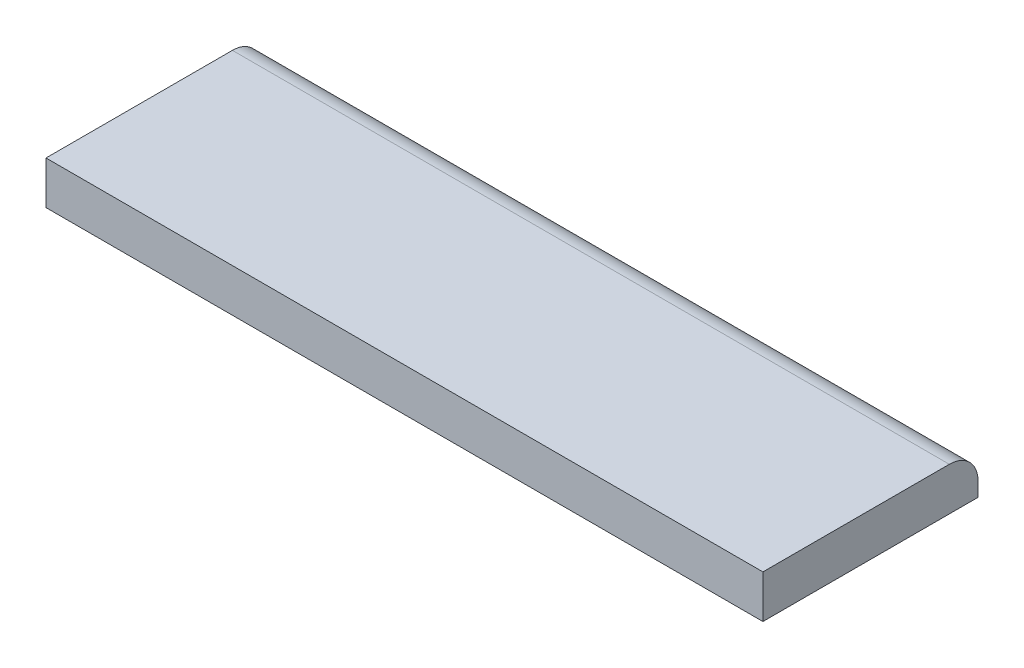
ISO-10303-21;
HEADER;
FILE_DESCRIPTION(('STEP AP214'),'2;1');
FILE_NAME('part.step','',(''),(''),'','','');
FILE_SCHEMA(('AUTOMOTIVE_DESIGN { 1 0 10303 214 1 1 1 1 }'));
ENDSEC;
DATA;
#1=APPLICATION_CONTEXT('core data for automotive mechanical design processes');
#2=APPLICATION_PROTOCOL_DEFINITION('international standard','automotive_design',2000,#1);
#3=PRODUCT_CONTEXT('',#1,'mechanical');
#4=PRODUCT('Part','Part','',(#3));
#5=PRODUCT_RELATED_PRODUCT_CATEGORY('part','',(#4));
#6=PRODUCT_DEFINITION_FORMATION('','',#4);
#7=PRODUCT_DEFINITION_CONTEXT('part definition',#1,'design');
#8=PRODUCT_DEFINITION('design','',#6,#7);
#9=PRODUCT_DEFINITION_SHAPE('','',#8);
#10=(LENGTH_UNIT() NAMED_UNIT(*) SI_UNIT(.MILLI.,.METRE.));
#11=(NAMED_UNIT(*) PLANE_ANGLE_UNIT() SI_UNIT($,.RADIAN.));
#12=(NAMED_UNIT(*) SI_UNIT($,.STERADIAN.) SOLID_ANGLE_UNIT());
#13=UNCERTAINTY_MEASURE_WITH_UNIT(LENGTH_MEASURE(1.E-05),#10,'distance_accuracy_value','');
#14=(GEOMETRIC_REPRESENTATION_CONTEXT(3) GLOBAL_UNCERTAINTY_ASSIGNED_CONTEXT((#13)) GLOBAL_UNIT_ASSIGNED_CONTEXT((#10,
#11,#12)) REPRESENTATION_CONTEXT('',''));
#15=CARTESIAN_POINT('',(0.,0.,0.));
#16=DIRECTION('',(0.,0.,1.));
#17=DIRECTION('',(1.,0.,0.));
#18=AXIS2_PLACEMENT_3D('',#15,#16,#17);
#19=CARTESIAN_POINT('',(0.,3.,0.));
#20=DIRECTION('',(1.,0.,0.));
#21=DIRECTION('',(0.,0.,-1.));
#22=AXIS2_PLACEMENT_3D('',#19,#20,#21);
#23=PLANE('',#22);
#24=DIRECTION('',(0.,0.,1.));
#25=VECTOR('',#24,1.);
#26=CARTESIAN_POINT('',(0.,3.,0.));
#27=LINE('',#26,#25);
#28=CARTESIAN_POINT('',(0.,3.,-13.));
#29=VERTEX_POINT('',#28);
#30=CARTESIAN_POINT('',(0.,3.,0.));
#31=VERTEX_POINT('',#30);
#32=EDGE_CURVE('E76',#29,#31,#27,.T.);
#33=ORIENTED_EDGE('',*,*,#32,.F.);
#34=CARTESIAN_POINT('',(0.,1.,-13.));
#35=DIRECTION('',(1.,0.,0.));
#36=DIRECTION('',(0.,0.,-1.));
#37=AXIS2_PLACEMENT_3D('',#34,#35,#36);
#38=CIRCLE('',#37,2.);
#39=CARTESIAN_POINT('',(0.,1.,-15.));
#40=VERTEX_POINT('',#39);
#41=EDGE_CURVE('E54',#29,#40,#38,.F.);
#42=ORIENTED_EDGE('',*,*,#41,.T.);
#43=DIRECTION('',(0.,-1.,0.));
#44=VECTOR('',#43,1.);
#45=CARTESIAN_POINT('',(0.,3.,-15.));
#46=LINE('',#45,#44);
#47=CARTESIAN_POINT('',(0.,0.,-15.));
#48=VERTEX_POINT('',#47);
#49=EDGE_CURVE('E106',#40,#48,#46,.T.);
#50=ORIENTED_EDGE('',*,*,#49,.T.);
#51=DIRECTION('',(0.,0.,1.));
#52=VECTOR('',#51,1.);
#53=CARTESIAN_POINT('',(0.,0.,0.));
#54=LINE('',#53,#52);
#55=CARTESIAN_POINT('',(0.,0.,0.));
#56=VERTEX_POINT('',#55);
#57=EDGE_CURVE('E98',#48,#56,#54,.T.);
#58=ORIENTED_EDGE('',*,*,#57,.T.);
#59=DIRECTION('',(0.,-1.,0.));
#60=VECTOR('',#59,1.);
#61=CARTESIAN_POINT('',(0.,3.,0.));
#62=LINE('',#61,#60);
#63=EDGE_CURVE('E90',#31,#56,#62,.T.);
#64=ORIENTED_EDGE('',*,*,#63,.F.);
#65=EDGE_LOOP('',(#33,#42,#50,#58,#64));
#66=FACE_BOUND('',#65,.T.);
#67=ADVANCED_FACE('F32',(#66),#23,.F.);
#68=CARTESIAN_POINT('',(0.,3.,0.));
#69=DIRECTION('',(0.,0.,-1.));
#70=DIRECTION('',(-1.,0.,0.));
#71=AXIS2_PLACEMENT_3D('',#68,#69,#70);
#72=PLANE('',#71);
#73=DIRECTION('',(1.,0.,0.));
#74=VECTOR('',#73,1.);
#75=CARTESIAN_POINT('',(0.,0.,0.));
#76=LINE('',#75,#74);
#77=CARTESIAN_POINT('',(50.,0.,0.));
#78=VERTEX_POINT('',#77);
#79=EDGE_CURVE('E113',#56,#78,#76,.T.);
#80=ORIENTED_EDGE('',*,*,#79,.T.);
#81=DIRECTION('',(0.,-1.,0.));
#82=VECTOR('',#81,1.);
#83=CARTESIAN_POINT('',(50.,3.,0.));
#84=LINE('',#83,#82);
#85=CARTESIAN_POINT('',(50.,3.,0.));
#86=VERTEX_POINT('',#85);
#87=EDGE_CURVE('E93',#86,#78,#84,.T.);
#88=ORIENTED_EDGE('',*,*,#87,.F.);
#89=DIRECTION('',(1.,0.,0.));
#90=VECTOR('',#89,1.);
#91=CARTESIAN_POINT('',(0.,3.,0.));
#92=LINE('',#91,#90);
#93=EDGE_CURVE('E80',#31,#86,#92,.T.);
#94=ORIENTED_EDGE('',*,*,#93,.F.);
#95=ORIENTED_EDGE('',*,*,#63,.T.);
#96=EDGE_LOOP('',(#80,#88,#94,#95));
#97=FACE_BOUND('',#96,.T.);
#98=ADVANCED_FACE('F89',(#97),#72,.F.);
#99=CARTESIAN_POINT('',(50.,3.,0.));
#100=DIRECTION('',(-1.,0.,0.));
#101=DIRECTION('',(0.,0.,1.));
#102=AXIS2_PLACEMENT_3D('',#99,#100,#101);
#103=PLANE('',#102);
#104=DIRECTION('',(0.,-1.,0.));
#105=VECTOR('',#104,1.);
#106=CARTESIAN_POINT('',(50.,3.,-15.));
#107=LINE('',#106,#105);
#108=CARTESIAN_POINT('',(50.,1.,-15.));
#109=VERTEX_POINT('',#108);
#110=CARTESIAN_POINT('',(50.,0.,-15.));
#111=VERTEX_POINT('',#110);
#112=EDGE_CURVE('E101',#109,#111,#107,.T.);
#113=ORIENTED_EDGE('',*,*,#112,.F.);
#114=CARTESIAN_POINT('',(50.,1.,-13.));
#115=DIRECTION('',(-1.,0.,0.));
#116=DIRECTION('',(0.,0.,1.));
#117=AXIS2_PLACEMENT_3D('',#114,#115,#116);
#118=CIRCLE('',#117,2.);
#119=CARTESIAN_POINT('',(50.,3.,-13.));
#120=VERTEX_POINT('',#119);
#121=EDGE_CURVE('E11',#109,#120,#118,.F.);
#122=ORIENTED_EDGE('',*,*,#121,.T.);
#123=DIRECTION('',(0.,0.,-1.));
#124=VECTOR('',#123,1.);
#125=CARTESIAN_POINT('',(50.,3.,0.));
#126=LINE('',#125,#124);
#127=EDGE_CURVE('E95',#86,#120,#126,.T.);
#128=ORIENTED_EDGE('',*,*,#127,.F.);
#129=ORIENTED_EDGE('',*,*,#87,.T.);
#130=DIRECTION('',(0.,0.,-1.));
#131=VECTOR('',#130,1.);
#132=CARTESIAN_POINT('',(50.,0.,0.));
#133=LINE('',#132,#131);
#134=EDGE_CURVE('E110',#78,#111,#133,.T.);
#135=ORIENTED_EDGE('',*,*,#134,.T.);
#136=EDGE_LOOP('',(#113,#122,#128,#129,#135));
#137=FACE_BOUND('',#136,.T.);
#138=ADVANCED_FACE('F119',(#137),#103,.F.);
#139=CARTESIAN_POINT('',(0.,3.,-15.));
#140=DIRECTION('',(0.,0.,1.));
#141=DIRECTION('',(1.,0.,0.));
#142=AXIS2_PLACEMENT_3D('',#139,#140,#141);
#143=PLANE('',#142);
#144=ORIENTED_EDGE('',*,*,#49,.F.);
#145=DIRECTION('',(-1.,0.,0.));
#146=VECTOR('',#145,1.);
#147=CARTESIAN_POINT('',(0.,1.,-15.));
#148=LINE('',#147,#146);
#149=EDGE_CURVE('E40',#40,#109,#148,.F.);
#150=ORIENTED_EDGE('',*,*,#149,.T.);
#151=ORIENTED_EDGE('',*,*,#112,.T.);
#152=DIRECTION('',(-1.,0.,0.));
#153=VECTOR('',#152,1.);
#154=CARTESIAN_POINT('',(0.,0.,-15.));
#155=LINE('',#154,#153);
#156=EDGE_CURVE('E85',#111,#48,#155,.T.);
#157=ORIENTED_EDGE('',*,*,#156,.T.);
#158=EDGE_LOOP('',(#144,#150,#151,#157));
#159=FACE_BOUND('',#158,.T.);
#160=ADVANCED_FACE('F122',(#159),#143,.F.);
#161=CARTESIAN_POINT('',(0.,3.,0.));
#162=DIRECTION('',(0.,-1.,0.));
#163=DIRECTION('',(0.,0.,-1.));
#164=AXIS2_PLACEMENT_3D('',#161,#162,#163);
#165=PLANE('',#164);
#166=ORIENTED_EDGE('',*,*,#127,.T.);
#167=DIRECTION('',(-1.,0.,0.));
#168=VECTOR('',#167,1.);
#169=CARTESIAN_POINT('',(0.,3.,-13.));
#170=LINE('',#169,#168);
#171=EDGE_CURVE('E83',#120,#29,#170,.T.);
#172=ORIENTED_EDGE('',*,*,#171,.T.);
#173=ORIENTED_EDGE('',*,*,#32,.T.);
#174=ORIENTED_EDGE('',*,*,#93,.T.);
#175=EDGE_LOOP('',(#166,#172,#173,#174));
#176=FACE_BOUND('',#175,.T.);
#177=ADVANCED_FACE('F79',(#176),#165,.F.);
#178=CARTESIAN_POINT('',(0.,0.,0.));
#179=DIRECTION('',(0.,-1.,0.));
#180=DIRECTION('',(0.,0.,-1.));
#181=AXIS2_PLACEMENT_3D('',#178,#179,#180);
#182=PLANE('',#181);
#183=ORIENTED_EDGE('',*,*,#57,.F.);
#184=ORIENTED_EDGE('',*,*,#156,.F.);
#185=ORIENTED_EDGE('',*,*,#134,.F.);
#186=ORIENTED_EDGE('',*,*,#79,.F.);
#187=EDGE_LOOP('',(#183,#184,#185,#186));
#188=FACE_BOUND('',#187,.T.);
#189=ADVANCED_FACE('F124',(#188),#182,.T.);
#190=CARTESIAN_POINT('',(0.,1.,-13.));
#191=DIRECTION('',(-1.,0.,0.));
#192=DIRECTION('',(0.,0.,1.));
#193=AXIS2_PLACEMENT_3D('',#190,#191,#192);
#194=CYLINDRICAL_SURFACE('',#193,2.);
#195=ORIENTED_EDGE('',*,*,#121,.F.);
#196=ORIENTED_EDGE('',*,*,#149,.F.);
#197=ORIENTED_EDGE('',*,*,#41,.F.);
#198=ORIENTED_EDGE('',*,*,#171,.F.);
#199=EDGE_LOOP('',(#195,#196,#197,#198));
#200=FACE_BOUND('',#199,.T.);
#201=ADVANCED_FACE('F34',(#200),#194,.T.);
#202=CLOSED_SHELL('',(#67,#98,#138,#160,#177,#189,#201));
#203=MANIFOLD_SOLID_BREP('B2',#202);
#204=ADVANCED_BREP_SHAPE_REPRESENTATION('',(#18,#203),#14);
#205=SHAPE_DEFINITION_REPRESENTATION(#9,#204);
ENDSEC;
END-ISO-10303-21;
